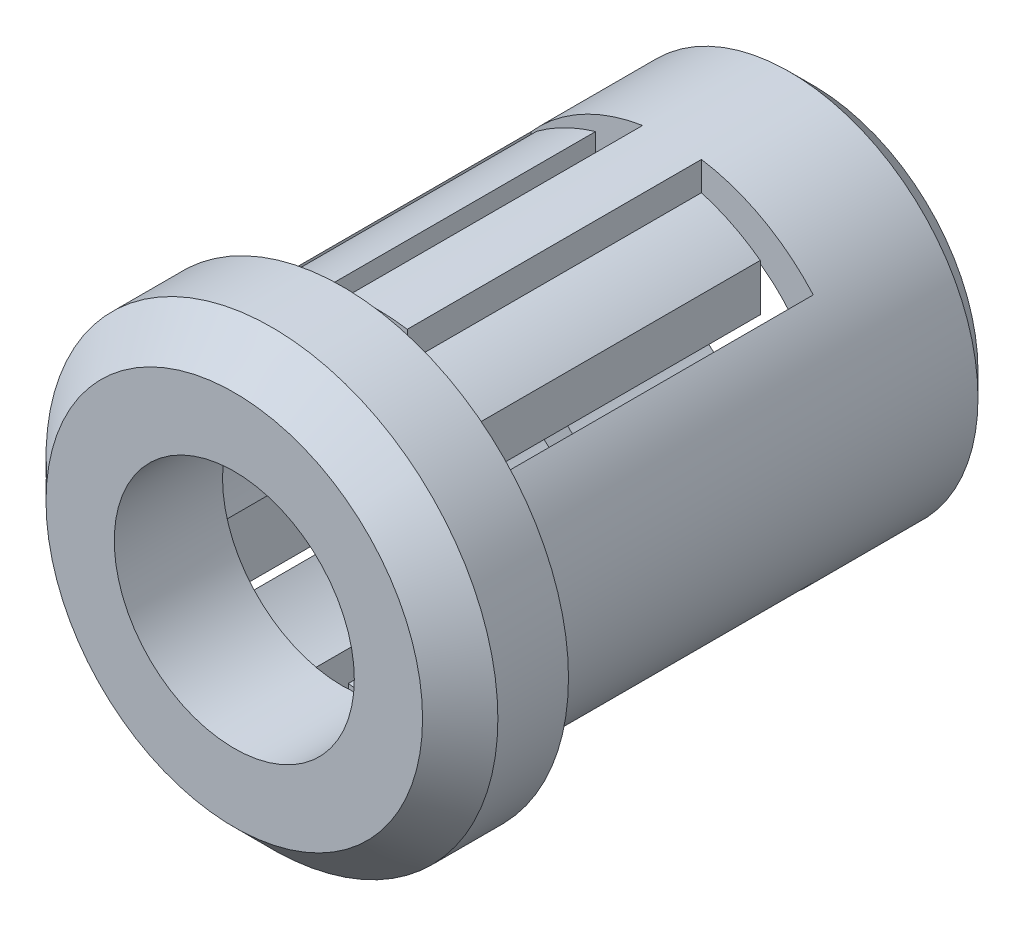
ISO-10303-21;
HEADER;
FILE_DESCRIPTION(('STEP AP214'),'2;1');
FILE_NAME('part.step','',(''),(''),'','','');
FILE_SCHEMA(('AUTOMOTIVE_DESIGN { 1 0 10303 214 1 1 1 1 }'));
ENDSEC;
DATA;
#1=APPLICATION_CONTEXT('core data for automotive mechanical design processes');
#2=APPLICATION_PROTOCOL_DEFINITION('international standard','automotive_design',2000,#1);
#3=PRODUCT_CONTEXT('',#1,'mechanical');
#4=PRODUCT('Part','Part','',(#3));
#5=PRODUCT_RELATED_PRODUCT_CATEGORY('part','',(#4));
#6=PRODUCT_DEFINITION_FORMATION('','',#4);
#7=PRODUCT_DEFINITION_CONTEXT('part definition',#1,'design');
#8=PRODUCT_DEFINITION('design','',#6,#7);
#9=PRODUCT_DEFINITION_SHAPE('','',#8);
#10=(LENGTH_UNIT() NAMED_UNIT(*) SI_UNIT(.MILLI.,.METRE.));
#11=(NAMED_UNIT(*) PLANE_ANGLE_UNIT() SI_UNIT($,.RADIAN.));
#12=(NAMED_UNIT(*) SI_UNIT($,.STERADIAN.) SOLID_ANGLE_UNIT());
#13=UNCERTAINTY_MEASURE_WITH_UNIT(LENGTH_MEASURE(1.E-05),#10,'distance_accuracy_value','');
#14=(GEOMETRIC_REPRESENTATION_CONTEXT(3) GLOBAL_UNCERTAINTY_ASSIGNED_CONTEXT((#13)) GLOBAL_UNIT_ASSIGNED_CONTEXT((#10,
#11,#12)) REPRESENTATION_CONTEXT('',''));
#15=CARTESIAN_POINT('',(0.,0.,0.));
#16=DIRECTION('',(0.,0.,1.));
#17=DIRECTION('',(1.,0.,0.));
#18=AXIS2_PLACEMENT_3D('',#15,#16,#17);
#19=CARTESIAN_POINT('',(0.,0.,10.));
#20=DIRECTION('',(0.,0.,-1.));
#21=DIRECTION('',(-1.,0.,0.));
#22=AXIS2_PLACEMENT_3D('',#19,#20,#21);
#23=CYLINDRICAL_SURFACE('',#22,4.);
#24=CARTESIAN_POINT('',(0.,0.,0.499999999999995));
#25=DIRECTION('',(0.,0.,1.));
#26=DIRECTION('',(1.,0.,0.));
#27=AXIS2_PLACEMENT_3D('',#24,#25,#26);
#28=CIRCLE('',#27,4.);
#29=CARTESIAN_POINT('',(4.,0.,0.499999999999995));
#30=VERTEX_POINT('',#29);
#31=EDGE_CURVE('E281',#30,#30,#28,.T.);
#32=ORIENTED_EDGE('',*,*,#31,.T.);
#33=EDGE_LOOP('',(#32));
#34=FACE_BOUND('',#33,.T.);
#35=CARTESIAN_POINT('',(0.,0.,3.));
#36=DIRECTION('',(0.,0.,-1.));
#37=DIRECTION('',(-1.,0.,0.));
#38=AXIS2_PLACEMENT_3D('',#35,#36,#37);
#39=CIRCLE('',#38,4.);
#40=CARTESIAN_POINT('',(-0.625,-3.95087015731978,3.));
#41=VERTEX_POINT('',#40);
#42=CARTESIAN_POINT('',(-3.,-2.64575131106459,3.));
#43=VERTEX_POINT('',#42);
#44=EDGE_CURVE('E258',#41,#43,#39,.T.);
#45=ORIENTED_EDGE('',*,*,#44,.T.);
#46=DIRECTION('',(0.,0.,-1.));
#47=VECTOR('',#46,1.);
#48=CARTESIAN_POINT('',(-3.,-2.64575131106459,10.));
#49=LINE('',#48,#47);
#50=CARTESIAN_POINT('',(-3.,-2.64575131106459,10.));
#51=VERTEX_POINT('',#50);
#52=EDGE_CURVE('E247',#43,#51,#49,.F.);
#53=ORIENTED_EDGE('',*,*,#52,.T.);
#54=CARTESIAN_POINT('',(0.,0.,10.));
#55=DIRECTION('',(0.,0.,1.));
#56=DIRECTION('',(1.,0.,0.));
#57=AXIS2_PLACEMENT_3D('',#54,#55,#56);
#58=CIRCLE('',#57,4.);
#59=CARTESIAN_POINT('',(-3.,2.64575131106459,10.));
#60=VERTEX_POINT('',#59);
#61=EDGE_CURVE('E256',#60,#51,#58,.T.);
#62=ORIENTED_EDGE('',*,*,#61,.F.);
#63=DIRECTION('',(0.,0.,-1.));
#64=VECTOR('',#63,1.);
#65=CARTESIAN_POINT('',(-3.,2.64575131106459,10.));
#66=LINE('',#65,#64);
#67=CARTESIAN_POINT('',(-3.,2.64575131106459,3.));
#68=VERTEX_POINT('',#67);
#69=EDGE_CURVE('E259',#60,#68,#66,.T.);
#70=ORIENTED_EDGE('',*,*,#69,.T.);
#71=CARTESIAN_POINT('',(-0.625,3.95087015731978,3.));
#72=VERTEX_POINT('',#71);
#73=EDGE_CURVE('E260',#68,#72,#39,.T.);
#74=ORIENTED_EDGE('',*,*,#73,.T.);
#75=DIRECTION('',(0.,0.,-1.));
#76=VECTOR('',#75,1.);
#77=CARTESIAN_POINT('',(-0.624999999999999,3.95087015731978,10.));
#78=LINE('',#77,#76);
#79=CARTESIAN_POINT('',(-0.624999999999999,3.95087015731978,9.25));
#80=VERTEX_POINT('',#79);
#81=EDGE_CURVE('E476',#72,#80,#78,.F.);
#82=ORIENTED_EDGE('',*,*,#81,.T.);
#83=CARTESIAN_POINT('',(0.,0.,9.25));
#84=DIRECTION('',(0.,0.,-1.));
#85=DIRECTION('',(-1.,0.,0.));
#86=AXIS2_PLACEMENT_3D('',#83,#84,#85);
#87=CIRCLE('',#86,4.);
#88=CARTESIAN_POINT('',(0.625000000000001,3.95087015731978,9.25));
#89=VERTEX_POINT('',#88);
#90=EDGE_CURVE('E475',#80,#89,#87,.T.);
#91=ORIENTED_EDGE('',*,*,#90,.T.);
#92=DIRECTION('',(0.,0.,-1.));
#93=VECTOR('',#92,1.);
#94=CARTESIAN_POINT('',(0.625000000000001,3.95087015731978,10.));
#95=LINE('',#94,#93);
#96=CARTESIAN_POINT('',(0.625,3.95087015731978,3.));
#97=VERTEX_POINT('',#96);
#98=EDGE_CURVE('E470',#89,#97,#95,.T.);
#99=ORIENTED_EDGE('',*,*,#98,.T.);
#100=CARTESIAN_POINT('',(0.,0.,3.));
#101=DIRECTION('',(0.,0.,-1.));
#102=DIRECTION('',(-1.,0.,0.));
#103=AXIS2_PLACEMENT_3D('',#100,#101,#102);
#104=CIRCLE('',#103,4.);
#105=CARTESIAN_POINT('',(3.,2.64575131106459,3.));
#106=VERTEX_POINT('',#105);
#107=EDGE_CURVE('E466',#97,#106,#104,.T.);
#108=ORIENTED_EDGE('',*,*,#107,.T.);
#109=DIRECTION('',(0.,0.,-1.));
#110=VECTOR('',#109,1.);
#111=CARTESIAN_POINT('',(3.,2.64575131106459,10.));
#112=LINE('',#111,#110);
#113=CARTESIAN_POINT('',(3.,2.64575131106459,10.));
#114=VERTEX_POINT('',#113);
#115=EDGE_CURVE('E457',#106,#114,#112,.F.);
#116=ORIENTED_EDGE('',*,*,#115,.T.);
#117=CARTESIAN_POINT('',(3.,-2.64575131106459,10.));
#118=VERTEX_POINT('',#117);
#119=EDGE_CURVE('E269',#118,#114,#58,.T.);
#120=ORIENTED_EDGE('',*,*,#119,.F.);
#121=DIRECTION('',(0.,0.,-1.));
#122=VECTOR('',#121,1.);
#123=CARTESIAN_POINT('',(3.,-2.64575131106459,10.));
#124=LINE('',#123,#122);
#125=CARTESIAN_POINT('',(3.,-2.64575131106459,3.));
#126=VERTEX_POINT('',#125);
#127=EDGE_CURVE('E460',#118,#126,#124,.T.);
#128=ORIENTED_EDGE('',*,*,#127,.T.);
#129=CARTESIAN_POINT('',(0.625,-3.95087015731978,3.));
#130=VERTEX_POINT('',#129);
#131=EDGE_CURVE('E463',#126,#130,#104,.T.);
#132=ORIENTED_EDGE('',*,*,#131,.T.);
#133=DIRECTION('',(0.,0.,-1.));
#134=VECTOR('',#133,1.);
#135=CARTESIAN_POINT('',(0.625000000000001,-3.95087015731978,10.));
#136=LINE('',#135,#134);
#137=CARTESIAN_POINT('',(0.625000000000001,-3.95087015731978,9.25));
#138=VERTEX_POINT('',#137);
#139=EDGE_CURVE('E467',#130,#138,#136,.F.);
#140=ORIENTED_EDGE('',*,*,#139,.T.);
#141=CARTESIAN_POINT('',(-0.624999999999999,-3.95087015731978,9.25));
#142=VERTEX_POINT('',#141);
#143=EDGE_CURVE('E473',#138,#142,#87,.T.);
#144=ORIENTED_EDGE('',*,*,#143,.T.);
#145=DIRECTION('',(0.,0.,-1.));
#146=VECTOR('',#145,1.);
#147=CARTESIAN_POINT('',(-0.624999999999999,-3.95087015731978,10.));
#148=LINE('',#147,#146);
#149=EDGE_CURVE('E372',#142,#41,#148,.T.);
#150=ORIENTED_EDGE('',*,*,#149,.T.);
#151=EDGE_LOOP('',(#45,#53,#62,#70,#74,#82,#91,#99,#108,#116,#120,#128,#132,#140,#144,#150));
#152=FACE_BOUND('',#151,.T.);
#153=ADVANCED_FACE('F33',(#34,#152),#23,.T.);
#154=CARTESIAN_POINT('',(0.,0.,3.5));
#155=DIRECTION('',(0.,0.,1.));
#156=DIRECTION('',(1.,0.,0.));
#157=AXIS2_PLACEMENT_3D('',#154,#155,#156);
#158=CIRCLE('',#157,4.);
#159=CARTESIAN_POINT('',(1.125,-3.83853813319602,3.5));
#160=VERTEX_POINT('',#159);
#161=CARTESIAN_POINT('',(2.375,-3.21859829739593,3.5));
#162=VERTEX_POINT('',#161);
#163=EDGE_CURVE('E447',#160,#162,#158,.T.);
#164=ORIENTED_EDGE('',*,*,#163,.T.);
#165=DIRECTION('',(0.,0.,-1.));
#166=VECTOR('',#165,1.);
#167=CARTESIAN_POINT('',(2.375,-3.21859829739593,10.));
#168=LINE('',#167,#166);
#169=CARTESIAN_POINT('',(2.375,-3.21859829739593,10.));
#170=VERTEX_POINT('',#169);
#171=EDGE_CURVE('E451',#162,#170,#168,.F.);
#172=ORIENTED_EDGE('',*,*,#171,.T.);
#173=CARTESIAN_POINT('',(1.125,-3.83853813319602,10.));
#174=VERTEX_POINT('',#173);
#175=EDGE_CURVE('E268',#174,#170,#58,.T.);
#176=ORIENTED_EDGE('',*,*,#175,.F.);
#177=DIRECTION('',(0.,0.,-1.));
#178=VECTOR('',#177,1.);
#179=CARTESIAN_POINT('',(1.125,-3.83853813319602,10.));
#180=LINE('',#179,#178);
#181=EDGE_CURVE('E444',#174,#160,#180,.T.);
#182=ORIENTED_EDGE('',*,*,#181,.T.);
#183=EDGE_LOOP('',(#164,#172,#176,#182));
#184=FACE_BOUND('',#183,.T.);
#185=ADVANCED_FACE('F520',(#184),#23,.T.);
#186=CARTESIAN_POINT('',(2.375,3.21859829739593,10.));
#187=VERTEX_POINT('',#186);
#188=CARTESIAN_POINT('',(1.125,3.83853813319602,10.));
#189=VERTEX_POINT('',#188);
#190=EDGE_CURVE('E267',#187,#189,#58,.T.);
#191=ORIENTED_EDGE('',*,*,#190,.F.);
#192=DIRECTION('',(0.,0.,-1.));
#193=VECTOR('',#192,1.);
#194=CARTESIAN_POINT('',(2.375,3.21859829739593,10.));
#195=LINE('',#194,#193);
#196=CARTESIAN_POINT('',(2.375,3.21859829739593,3.5));
#197=VERTEX_POINT('',#196);
#198=EDGE_CURVE('E454',#187,#197,#195,.T.);
#199=ORIENTED_EDGE('',*,*,#198,.T.);
#200=CARTESIAN_POINT('',(1.125,3.83853813319602,3.5));
#201=VERTEX_POINT('',#200);
#202=EDGE_CURVE('E450',#197,#201,#158,.T.);
#203=ORIENTED_EDGE('',*,*,#202,.T.);
#204=DIRECTION('',(0.,0.,-1.));
#205=VECTOR('',#204,1.);
#206=CARTESIAN_POINT('',(1.125,3.83853813319602,10.));
#207=LINE('',#206,#205);
#208=EDGE_CURVE('E441',#201,#189,#207,.F.);
#209=ORIENTED_EDGE('',*,*,#208,.T.);
#210=EDGE_LOOP('',(#191,#199,#203,#209));
#211=FACE_BOUND('',#210,.T.);
#212=ADVANCED_FACE('F525',(#211),#23,.T.);
#213=CARTESIAN_POINT('',(0.,0.,3.5));
#214=DIRECTION('',(0.,0.,1.));
#215=DIRECTION('',(1.,0.,0.));
#216=AXIS2_PLACEMENT_3D('',#213,#214,#215);
#217=CIRCLE('',#216,4.);
#218=CARTESIAN_POINT('',(-2.375,-3.21859829739593,3.5));
#219=VERTEX_POINT('',#218);
#220=CARTESIAN_POINT('',(-1.125,-3.83853813319602,3.5));
#221=VERTEX_POINT('',#220);
#222=EDGE_CURVE('E431',#219,#221,#217,.T.);
#223=ORIENTED_EDGE('',*,*,#222,.T.);
#224=DIRECTION('',(0.,0.,-1.));
#225=VECTOR('',#224,1.);
#226=CARTESIAN_POINT('',(-1.125,-3.83853813319602,10.));
#227=LINE('',#226,#225);
#228=CARTESIAN_POINT('',(-1.125,-3.83853813319602,10.));
#229=VERTEX_POINT('',#228);
#230=EDGE_CURVE('E435',#221,#229,#227,.F.);
#231=ORIENTED_EDGE('',*,*,#230,.T.);
#232=CARTESIAN_POINT('',(-2.375,-3.21859829739593,10.));
#233=VERTEX_POINT('',#232);
#234=EDGE_CURVE('E264',#233,#229,#58,.T.);
#235=ORIENTED_EDGE('',*,*,#234,.F.);
#236=DIRECTION('',(0.,0.,-1.));
#237=VECTOR('',#236,1.);
#238=CARTESIAN_POINT('',(-2.375,-3.21859829739593,10.));
#239=LINE('',#238,#237);
#240=EDGE_CURVE('E427',#233,#219,#239,.T.);
#241=ORIENTED_EDGE('',*,*,#240,.T.);
#242=EDGE_LOOP('',(#223,#231,#235,#241));
#243=FACE_BOUND('',#242,.T.);
#244=ADVANCED_FACE('F513',(#243),#23,.T.);
#245=CARTESIAN_POINT('',(0.,0.,10.));
#246=DIRECTION('',(0.,0.,-1.));
#247=DIRECTION('',(-1.,0.,0.));
#248=AXIS2_PLACEMENT_3D('',#245,#246,#247);
#249=CYLINDRICAL_SURFACE('',#248,3.25);
#250=CARTESIAN_POINT('',(0.,0.,0.));
#251=DIRECTION('',(0.,0.,-1.));
#252=DIRECTION('',(-1.,0.,0.));
#253=AXIS2_PLACEMENT_3D('',#250,#251,#252);
#254=CIRCLE('',#253,3.25);
#255=CARTESIAN_POINT('',(-3.25,0.,0.));
#256=VERTEX_POINT('',#255);
#257=EDGE_CURVE('E482',#256,#256,#254,.T.);
#258=ORIENTED_EDGE('',*,*,#257,.T.);
#259=EDGE_LOOP('',(#258));
#260=FACE_BOUND('',#259,.T.);
#261=CARTESIAN_POINT('',(0.,0.,10.));
#262=DIRECTION('',(0.,0.,-1.));
#263=DIRECTION('',(-1.,0.,0.));
#264=AXIS2_PLACEMENT_3D('',#261,#262,#263);
#265=CIRCLE('',#264,3.25);
#266=CARTESIAN_POINT('',(-3.,-1.25,10.));
#267=VERTEX_POINT('',#266);
#268=CARTESIAN_POINT('',(-3.,1.25,10.));
#269=VERTEX_POINT('',#268);
#270=EDGE_CURVE('E483',#267,#269,#265,.T.);
#271=ORIENTED_EDGE('',*,*,#270,.F.);
#272=DIRECTION('',(0.,0.,-1.));
#273=VECTOR('',#272,1.);
#274=CARTESIAN_POINT('',(-3.,-1.25,10.));
#275=LINE('',#274,#273);
#276=CARTESIAN_POINT('',(-3.,-1.25,3.));
#277=VERTEX_POINT('',#276);
#278=EDGE_CURVE('E11',#267,#277,#275,.T.);
#279=ORIENTED_EDGE('',*,*,#278,.T.);
#280=CARTESIAN_POINT('',(0.,0.,3.));
#281=DIRECTION('',(0.,0.,-1.));
#282=DIRECTION('',(-1.,0.,0.));
#283=AXIS2_PLACEMENT_3D('',#280,#281,#282);
#284=CIRCLE('',#283,3.25);
#285=CARTESIAN_POINT('',(-0.625,-3.18933770554327,3.));
#286=VERTEX_POINT('',#285);
#287=EDGE_CURVE('E41',#277,#286,#284,.F.);
#288=ORIENTED_EDGE('',*,*,#287,.T.);
#289=DIRECTION('',(0.,0.,-1.));
#290=VECTOR('',#289,1.);
#291=CARTESIAN_POINT('',(-0.624999999999999,-3.18933770554327,10.));
#292=LINE('',#291,#290);
#293=CARTESIAN_POINT('',(-0.624999999999999,-3.18933770554327,9.25));
#294=VERTEX_POINT('',#293);
#295=EDGE_CURVE('E352',#286,#294,#292,.F.);
#296=ORIENTED_EDGE('',*,*,#295,.T.);
#297=CARTESIAN_POINT('',(0.,0.,9.25));
#298=DIRECTION('',(0.,0.,-1.));
#299=DIRECTION('',(-1.,0.,0.));
#300=AXIS2_PLACEMENT_3D('',#297,#298,#299);
#301=CIRCLE('',#300,3.25);
#302=CARTESIAN_POINT('',(0.625000000000001,-3.18933770554327,9.25));
#303=VERTEX_POINT('',#302);
#304=EDGE_CURVE('E338',#294,#303,#301,.F.);
#305=ORIENTED_EDGE('',*,*,#304,.T.);
#306=DIRECTION('',(0.,0.,-1.));
#307=VECTOR('',#306,1.);
#308=CARTESIAN_POINT('',(0.625000000000001,-3.18933770554327,10.));
#309=LINE('',#308,#307);
#310=CARTESIAN_POINT('',(0.625,-3.18933770554327,3.));
#311=VERTEX_POINT('',#310);
#312=EDGE_CURVE('E350',#303,#311,#309,.T.);
#313=ORIENTED_EDGE('',*,*,#312,.T.);
#314=CARTESIAN_POINT('',(0.,0.,3.));
#315=DIRECTION('',(0.,0.,-1.));
#316=DIRECTION('',(-1.,0.,0.));
#317=AXIS2_PLACEMENT_3D('',#314,#315,#316);
#318=CIRCLE('',#317,3.25);
#319=CARTESIAN_POINT('',(3.,-1.25,3.));
#320=VERTEX_POINT('',#319);
#321=EDGE_CURVE('E331',#311,#320,#318,.F.);
#322=ORIENTED_EDGE('',*,*,#321,.T.);
#323=DIRECTION('',(0.,0.,-1.));
#324=VECTOR('',#323,1.);
#325=CARTESIAN_POINT('',(3.,-1.25,10.));
#326=LINE('',#325,#324);
#327=CARTESIAN_POINT('',(3.,-1.25,10.));
#328=VERTEX_POINT('',#327);
#329=EDGE_CURVE('E347',#320,#328,#326,.F.);
#330=ORIENTED_EDGE('',*,*,#329,.T.);
#331=CARTESIAN_POINT('',(3.,1.25,10.));
#332=VERTEX_POINT('',#331);
#333=EDGE_CURVE('E907',#332,#328,#265,.T.);
#334=ORIENTED_EDGE('',*,*,#333,.F.);
#335=DIRECTION('',(0.,0.,-1.));
#336=VECTOR('',#335,1.);
#337=CARTESIAN_POINT('',(3.,1.25,10.));
#338=LINE('',#337,#336);
#339=CARTESIAN_POINT('',(3.,1.25,3.));
#340=VERTEX_POINT('',#339);
#341=EDGE_CURVE('E324',#332,#340,#338,.T.);
#342=ORIENTED_EDGE('',*,*,#341,.T.);
#343=CARTESIAN_POINT('',(0.625,3.18933770554327,3.));
#344=VERTEX_POINT('',#343);
#345=EDGE_CURVE('E327',#340,#344,#318,.F.);
#346=ORIENTED_EDGE('',*,*,#345,.T.);
#347=DIRECTION('',(0.,0.,-1.));
#348=VECTOR('',#347,1.);
#349=CARTESIAN_POINT('',(0.625000000000001,3.18933770554327,10.));
#350=LINE('',#349,#348);
#351=CARTESIAN_POINT('',(0.625000000000001,3.18933770554327,9.25));
#352=VERTEX_POINT('',#351);
#353=EDGE_CURVE('E330',#344,#352,#350,.F.);
#354=ORIENTED_EDGE('',*,*,#353,.T.);
#355=CARTESIAN_POINT('',(-0.624999999999999,3.18933770554327,9.25));
#356=VERTEX_POINT('',#355);
#357=EDGE_CURVE('E334',#352,#356,#301,.F.);
#358=ORIENTED_EDGE('',*,*,#357,.T.);
#359=DIRECTION('',(0.,0.,-1.));
#360=VECTOR('',#359,1.);
#361=CARTESIAN_POINT('',(-0.624999999999999,3.18933770554327,10.));
#362=LINE('',#361,#360);
#363=CARTESIAN_POINT('',(-0.625,3.18933770554327,3.));
#364=VERTEX_POINT('',#363);
#365=EDGE_CURVE('E337',#356,#364,#362,.T.);
#366=ORIENTED_EDGE('',*,*,#365,.T.);
#367=CARTESIAN_POINT('',(-3.,1.25,3.));
#368=VERTEX_POINT('',#367);
#369=EDGE_CURVE('E341',#364,#368,#284,.F.);
#370=ORIENTED_EDGE('',*,*,#369,.T.);
#371=DIRECTION('',(0.,0.,-1.));
#372=VECTOR('',#371,1.);
#373=CARTESIAN_POINT('',(-3.,1.25,10.));
#374=LINE('',#373,#372);
#375=EDGE_CURVE('E344',#368,#269,#374,.F.);
#376=ORIENTED_EDGE('',*,*,#375,.T.);
#377=EDGE_LOOP('',(#271,#279,#288,#296,#305,#313,#322,#330,#334,#342,#346,#354,#358,#366,#370,#376));
#378=FACE_BOUND('',#377,.T.);
#379=ADVANCED_FACE('F357',(#260,#378),#249,.F.);
#380=CARTESIAN_POINT('',(2.375,-2.21852991866236,10.));
#381=VERTEX_POINT('',#380);
#382=CARTESIAN_POINT('',(1.125,-3.04907772941262,10.));
#383=VERTEX_POINT('',#382);
#384=EDGE_CURVE('E911',#381,#383,#265,.T.);
#385=ORIENTED_EDGE('',*,*,#384,.F.);
#386=DIRECTION('',(0.,0.,-1.));
#387=VECTOR('',#386,1.);
#388=CARTESIAN_POINT('',(2.375,-2.21852991866236,10.));
#389=LINE('',#388,#387);
#390=CARTESIAN_POINT('',(2.375,-2.21852991866236,3.5));
#391=VERTEX_POINT('',#390);
#392=EDGE_CURVE('E321',#381,#391,#389,.T.);
#393=ORIENTED_EDGE('',*,*,#392,.T.);
#394=CARTESIAN_POINT('',(0.,0.,3.5));
#395=DIRECTION('',(0.,0.,1.));
#396=DIRECTION('',(1.,0.,0.));
#397=AXIS2_PLACEMENT_3D('',#394,#395,#396);
#398=CIRCLE('',#397,3.25);
#399=CARTESIAN_POINT('',(1.125,-3.04907772941262,3.5));
#400=VERTEX_POINT('',#399);
#401=EDGE_CURVE('E315',#391,#400,#398,.F.);
#402=ORIENTED_EDGE('',*,*,#401,.T.);
#403=DIRECTION('',(0.,0.,-1.));
#404=VECTOR('',#403,1.);
#405=CARTESIAN_POINT('',(1.125,-3.04907772941262,10.));
#406=LINE('',#405,#404);
#407=EDGE_CURVE('E318',#400,#383,#406,.F.);
#408=ORIENTED_EDGE('',*,*,#407,.T.);
#409=EDGE_LOOP('',(#385,#393,#402,#408));
#410=FACE_BOUND('',#409,.T.);
#411=ADVANCED_FACE('F604',(#410),#249,.F.);
#412=CARTESIAN_POINT('',(1.125,3.04907772941262,3.5));
#413=VERTEX_POINT('',#412);
#414=CARTESIAN_POINT('',(2.375,2.21852991866236,3.5));
#415=VERTEX_POINT('',#414);
#416=EDGE_CURVE('E311',#413,#415,#398,.F.);
#417=ORIENTED_EDGE('',*,*,#416,.T.);
#418=DIRECTION('',(0.,0.,-1.));
#419=VECTOR('',#418,1.);
#420=CARTESIAN_POINT('',(2.375,2.21852991866236,10.));
#421=LINE('',#420,#419);
#422=CARTESIAN_POINT('',(2.375,2.21852991866236,10.));
#423=VERTEX_POINT('',#422);
#424=EDGE_CURVE('E314',#415,#423,#421,.F.);
#425=ORIENTED_EDGE('',*,*,#424,.T.);
#426=CARTESIAN_POINT('',(1.125,3.04907772941262,10.));
#427=VERTEX_POINT('',#426);
#428=EDGE_CURVE('E905',#427,#423,#265,.T.);
#429=ORIENTED_EDGE('',*,*,#428,.F.);
#430=DIRECTION('',(0.,0.,-1.));
#431=VECTOR('',#430,1.);
#432=CARTESIAN_POINT('',(1.125,3.04907772941262,10.));
#433=LINE('',#432,#431);
#434=EDGE_CURVE('E308',#427,#413,#433,.T.);
#435=ORIENTED_EDGE('',*,*,#434,.T.);
#436=EDGE_LOOP('',(#417,#425,#429,#435));
#437=FACE_BOUND('',#436,.T.);
#438=ADVANCED_FACE('F514',(#437),#249,.F.);
#439=CARTESIAN_POINT('',(-1.125,-3.04907772941262,10.));
#440=VERTEX_POINT('',#439);
#441=CARTESIAN_POINT('',(-2.375,-2.21852991866236,10.));
#442=VERTEX_POINT('',#441);
#443=EDGE_CURVE('E485',#440,#442,#265,.T.);
#444=ORIENTED_EDGE('',*,*,#443,.F.);
#445=DIRECTION('',(0.,0.,-1.));
#446=VECTOR('',#445,1.);
#447=CARTESIAN_POINT('',(-1.125,-3.04907772941262,10.));
#448=LINE('',#447,#446);
#449=CARTESIAN_POINT('',(-1.125,-3.04907772941262,3.5));
#450=VERTEX_POINT('',#449);
#451=EDGE_CURVE('E305',#440,#450,#448,.T.);
#452=ORIENTED_EDGE('',*,*,#451,.T.);
#453=CARTESIAN_POINT('',(0.,0.,3.5));
#454=DIRECTION('',(0.,0.,1.));
#455=DIRECTION('',(1.,0.,0.));
#456=AXIS2_PLACEMENT_3D('',#453,#454,#455);
#457=CIRCLE('',#456,3.25);
#458=CARTESIAN_POINT('',(-2.375,-2.21852991866236,3.5));
#459=VERTEX_POINT('',#458);
#460=EDGE_CURVE('E299',#450,#459,#457,.F.);
#461=ORIENTED_EDGE('',*,*,#460,.T.);
#462=DIRECTION('',(0.,0.,-1.));
#463=VECTOR('',#462,1.);
#464=CARTESIAN_POINT('',(-2.375,-2.21852991866236,10.));
#465=LINE('',#464,#463);
#466=EDGE_CURVE('E302',#459,#442,#465,.F.);
#467=ORIENTED_EDGE('',*,*,#466,.T.);
#468=EDGE_LOOP('',(#444,#452,#461,#467));
#469=FACE_BOUND('',#468,.T.);
#470=ADVANCED_FACE('F505',(#469),#249,.F.);
#471=CARTESIAN_POINT('',(0.,0.,9.3));
#472=DIRECTION('',(0.,0.,1.));
#473=DIRECTION('',(1.,0.,0.));
#474=AXIS2_PLACEMENT_3D('',#471,#472,#473);
#475=CYLINDRICAL_SURFACE('',#474,2.55);
#476=CARTESIAN_POINT('',(0.,0.,12.3));
#477=DIRECTION('',(0.,0.,1.));
#478=DIRECTION('',(1.,0.,0.));
#479=AXIS2_PLACEMENT_3D('',#476,#477,#478);
#480=CIRCLE('',#479,2.55);
#481=CARTESIAN_POINT('',(2.55,0.,12.3));
#482=VERTEX_POINT('',#481);
#483=EDGE_CURVE('E291',#482,#482,#480,.T.);
#484=ORIENTED_EDGE('',*,*,#483,.T.);
#485=EDGE_LOOP('',(#484));
#486=FACE_BOUND('',#485,.T.);
#487=CARTESIAN_POINT('',(0.,0.,10.));
#488=DIRECTION('',(0.,0.,-1.));
#489=DIRECTION('',(-1.,0.,0.));
#490=AXIS2_PLACEMENT_3D('',#487,#488,#489);
#491=CIRCLE('',#490,2.55);
#492=CARTESIAN_POINT('',(-2.55,0.,10.));
#493=VERTEX_POINT('',#492);
#494=EDGE_CURVE('E288',#493,#493,#491,.F.);
#495=ORIENTED_EDGE('',*,*,#494,.F.);
#496=EDGE_LOOP('',(#495));
#497=FACE_BOUND('',#496,.T.);
#498=ADVANCED_FACE('F502',(#486,#497),#475,.F.);
#499=CARTESIAN_POINT('',(-1.125,3.83853813319602,10.));
#500=VERTEX_POINT('',#499);
#501=CARTESIAN_POINT('',(-2.375,3.21859829739593,10.));
#502=VERTEX_POINT('',#501);
#503=EDGE_CURVE('E263',#500,#502,#58,.T.);
#504=ORIENTED_EDGE('',*,*,#503,.F.);
#505=DIRECTION('',(0.,0.,-1.));
#506=VECTOR('',#505,1.);
#507=CARTESIAN_POINT('',(-1.125,3.83853813319602,10.));
#508=LINE('',#507,#506);
#509=CARTESIAN_POINT('',(-1.125,3.83853813319602,3.5));
#510=VERTEX_POINT('',#509);
#511=EDGE_CURVE('E438',#500,#510,#508,.T.);
#512=ORIENTED_EDGE('',*,*,#511,.T.);
#513=CARTESIAN_POINT('',(-2.375,3.21859829739593,3.5));
#514=VERTEX_POINT('',#513);
#515=EDGE_CURVE('E434',#510,#514,#217,.T.);
#516=ORIENTED_EDGE('',*,*,#515,.T.);
#517=DIRECTION('',(0.,0.,-1.));
#518=VECTOR('',#517,1.);
#519=CARTESIAN_POINT('',(-2.375,3.21859829739593,10.));
#520=LINE('',#519,#518);
#521=EDGE_CURVE('E424',#514,#502,#520,.F.);
#522=ORIENTED_EDGE('',*,*,#521,.T.);
#523=EDGE_LOOP('',(#504,#512,#516,#522));
#524=FACE_BOUND('',#523,.T.);
#525=ADVANCED_FACE('F504',(#524),#23,.T.);
#526=CARTESIAN_POINT('',(0.,0.,0.));
#527=DIRECTION('',(0.,0.,1.));
#528=DIRECTION('',(1.,0.,0.));
#529=AXIS2_PLACEMENT_3D('',#526,#527,#528);
#530=PLANE('',#529);
#531=ORIENTED_EDGE('',*,*,#257,.F.);
#532=EDGE_LOOP('',(#531));
#533=FACE_BOUND('',#532,.T.);
#534=CARTESIAN_POINT('',(0.,0.,0.));
#535=DIRECTION('',(0.,0.,1.));
#536=DIRECTION('',(1.,0.,0.));
#537=AXIS2_PLACEMENT_3D('',#534,#535,#536);
#538=CIRCLE('',#537,3.5);
#539=CARTESIAN_POINT('',(3.5,0.,0.));
#540=VERTEX_POINT('',#539);
#541=EDGE_CURVE('E284',#540,#540,#538,.F.);
#542=ORIENTED_EDGE('',*,*,#541,.T.);
#543=EDGE_LOOP('',(#542));
#544=FACE_BOUND('',#543,.T.);
#545=ADVANCED_FACE('F497',(#533,#544),#530,.F.);
#546=CARTESIAN_POINT('',(0.,0.,10.));
#547=DIRECTION('',(0.,0.,1.));
#548=DIRECTION('',(1.,0.,0.));
#549=AXIS2_PLACEMENT_3D('',#546,#547,#548);
#550=PLANE('',#549);
#551=DIRECTION('',(0.,1.,0.));
#552=VECTOR('',#551,1.);
#553=CARTESIAN_POINT('',(2.375,-5.,10.));
#554=LINE('',#553,#552);
#555=EDGE_CURVE('E397',#423,#187,#554,.T.);
#556=ORIENTED_EDGE('',*,*,#555,.T.);
#557=ORIENTED_EDGE('',*,*,#190,.T.);
#558=DIRECTION('',(0.,1.,0.));
#559=VECTOR('',#558,1.);
#560=CARTESIAN_POINT('',(1.125,-5.,10.));
#561=LINE('',#560,#559);
#562=EDGE_CURVE('E409',#427,#189,#561,.T.);
#563=ORIENTED_EDGE('',*,*,#562,.F.);
#564=ORIENTED_EDGE('',*,*,#428,.T.);
#565=EDGE_LOOP('',(#556,#557,#563,#564));
#566=FACE_BOUND('',#565,.T.);
#567=DIRECTION('',(0.,1.,0.));
#568=VECTOR('',#567,1.);
#569=CARTESIAN_POINT('',(3.,-5.,10.));
#570=LINE('',#569,#568);
#571=EDGE_CURVE('E393',#118,#328,#570,.T.);
#572=ORIENTED_EDGE('',*,*,#571,.F.);
#573=ORIENTED_EDGE('',*,*,#119,.T.);
#574=EDGE_CURVE('E394',#332,#114,#570,.T.);
#575=ORIENTED_EDGE('',*,*,#574,.F.);
#576=ORIENTED_EDGE('',*,*,#333,.T.);
#577=EDGE_LOOP('',(#572,#573,#575,#576));
#578=FACE_BOUND('',#577,.T.);
#579=DIRECTION('',(0.,1.,0.));
#580=VECTOR('',#579,1.);
#581=CARTESIAN_POINT('',(-1.125,-5.,10.));
#582=LINE('',#581,#580);
#583=CARTESIAN_POINT('',(-1.125,3.04907772941262,10.));
#584=VERTEX_POINT('',#583);
#585=EDGE_CURVE('E412',#584,#500,#582,.T.);
#586=ORIENTED_EDGE('',*,*,#585,.T.);
#587=ORIENTED_EDGE('',*,*,#503,.T.);
#588=DIRECTION('',(0.,1.,0.));
#589=VECTOR('',#588,1.);
#590=CARTESIAN_POINT('',(-2.375,-5.,10.));
#591=LINE('',#590,#589);
#592=CARTESIAN_POINT('',(-2.375,2.21852991866236,10.));
#593=VERTEX_POINT('',#592);
#594=EDGE_CURVE('E250',#593,#502,#591,.T.);
#595=ORIENTED_EDGE('',*,*,#594,.F.);
#596=EDGE_CURVE('E292',#593,#584,#265,.T.);
#597=ORIENTED_EDGE('',*,*,#596,.T.);
#598=EDGE_LOOP('',(#586,#587,#595,#597));
#599=FACE_BOUND('',#598,.T.);
#600=EDGE_CURVE('E408',#174,#383,#561,.T.);
#601=ORIENTED_EDGE('',*,*,#600,.F.);
#602=ORIENTED_EDGE('',*,*,#175,.T.);
#603=EDGE_CURVE('E396',#170,#381,#554,.T.);
#604=ORIENTED_EDGE('',*,*,#603,.T.);
#605=ORIENTED_EDGE('',*,*,#384,.T.);
#606=EDGE_LOOP('',(#601,#602,#604,#605));
#607=FACE_BOUND('',#606,.T.);
#608=DIRECTION('',(0.,1.,0.));
#609=VECTOR('',#608,1.);
#610=CARTESIAN_POINT('',(-3.,-5.,10.));
#611=LINE('',#610,#609);
#612=EDGE_CURVE('E56',#269,#60,#611,.T.);
#613=ORIENTED_EDGE('',*,*,#612,.T.);
#614=ORIENTED_EDGE('',*,*,#61,.T.);
#615=EDGE_CURVE('E243',#51,#267,#611,.T.);
#616=ORIENTED_EDGE('',*,*,#615,.T.);
#617=ORIENTED_EDGE('',*,*,#270,.T.);
#618=EDGE_LOOP('',(#613,#614,#616,#617));
#619=FACE_BOUND('',#618,.T.);
#620=ORIENTED_EDGE('',*,*,#234,.T.);
#621=EDGE_CURVE('E411',#229,#440,#582,.T.);
#622=ORIENTED_EDGE('',*,*,#621,.T.);
#623=ORIENTED_EDGE('',*,*,#443,.T.);
#624=EDGE_CURVE('E48',#233,#442,#591,.T.);
#625=ORIENTED_EDGE('',*,*,#624,.F.);
#626=EDGE_LOOP('',(#620,#622,#623,#625));
#627=FACE_BOUND('',#626,.T.);
#628=CARTESIAN_POINT('',(0.,0.,10.));
#629=DIRECTION('',(0.,0.,1.));
#630=DIRECTION('',(1.,0.,0.));
#631=AXIS2_PLACEMENT_3D('',#628,#629,#630);
#632=CIRCLE('',#631,4.8);
#633=CARTESIAN_POINT('',(4.8,0.,10.));
#634=VERTEX_POINT('',#633);
#635=EDGE_CURVE('E273',#634,#634,#632,.T.);
#636=ORIENTED_EDGE('',*,*,#635,.F.);
#637=EDGE_LOOP('',(#636));
#638=FACE_BOUND('',#637,.T.);
#639=ORIENTED_EDGE('',*,*,#494,.T.);
#640=EDGE_LOOP('',(#639));
#641=FACE_BOUND('',#640,.T.);
#642=ADVANCED_FACE('F262',(#566,#578,#599,#607,#619,#627,#638,#641),#550,.F.);
#643=CARTESIAN_POINT('',(0.,0.,12.3));
#644=DIRECTION('',(0.,0.,-1.));
#645=DIRECTION('',(-1.,0.,0.));
#646=AXIS2_PLACEMENT_3D('',#643,#644,#645);
#647=CYLINDRICAL_SURFACE('',#646,4.8);
#648=CARTESIAN_POINT('',(0.,0.,11.5));
#649=DIRECTION('',(0.,0.,1.));
#650=DIRECTION('',(1.,0.,0.));
#651=AXIS2_PLACEMENT_3D('',#648,#649,#650);
#652=CIRCLE('',#651,4.8);
#653=CARTESIAN_POINT('',(4.8,0.,11.5));
#654=VERTEX_POINT('',#653);
#655=EDGE_CURVE('E278',#654,#654,#652,.F.);
#656=ORIENTED_EDGE('',*,*,#655,.T.);
#657=EDGE_LOOP('',(#656));
#658=FACE_BOUND('',#657,.T.);
#659=ORIENTED_EDGE('',*,*,#635,.T.);
#660=EDGE_LOOP('',(#659));
#661=FACE_BOUND('',#660,.T.);
#662=ADVANCED_FACE('F493',(#658,#661),#647,.T.);
#663=CARTESIAN_POINT('',(0.,0.,12.3));
#664=DIRECTION('',(0.,0.,1.));
#665=DIRECTION('',(1.,0.,0.));
#666=AXIS2_PLACEMENT_3D('',#663,#664,#665);
#667=PLANE('',#666);
#668=ORIENTED_EDGE('',*,*,#483,.F.);
#669=EDGE_LOOP('',(#668));
#670=FACE_BOUND('',#669,.T.);
#671=CARTESIAN_POINT('',(0.,0.,12.3));
#672=DIRECTION('',(0.,0.,1.));
#673=DIRECTION('',(1.,0.,0.));
#674=AXIS2_PLACEMENT_3D('',#671,#672,#673);
#675=CIRCLE('',#674,4.00000000000001);
#676=CARTESIAN_POINT('',(4.00000000000001,0.,12.3));
#677=VERTEX_POINT('',#676);
#678=EDGE_CURVE('E275',#677,#677,#675,.T.);
#679=ORIENTED_EDGE('',*,*,#678,.T.);
#680=EDGE_LOOP('',(#679));
#681=FACE_BOUND('',#680,.T.);
#682=ADVANCED_FACE('F531',(#670,#681),#667,.T.);
#683=CARTESIAN_POINT('',(0.,0.,12.3));
#684=DIRECTION('',(0.,0.,-1.));
#685=DIRECTION('',(-1.,0.,0.));
#686=AXIS2_PLACEMENT_3D('',#683,#684,#685);
#687=CONICAL_SURFACE('',#686,4.00000000000001,0.785398163397446);
#688=ORIENTED_EDGE('',*,*,#655,.F.);
#689=EDGE_LOOP('',(#688));
#690=FACE_BOUND('',#689,.T.);
#691=ORIENTED_EDGE('',*,*,#678,.F.);
#692=EDGE_LOOP('',(#691));
#693=FACE_BOUND('',#692,.T.);
#694=ADVANCED_FACE('F529',(#690,#693),#687,.T.);
#695=CARTESIAN_POINT('',(0.,0.,0.499999999999995));
#696=DIRECTION('',(0.,0.,1.));
#697=DIRECTION('',(1.,0.,0.));
#698=AXIS2_PLACEMENT_3D('',#695,#696,#697);
#699=CONICAL_SURFACE('',#698,4.,0.785398163397452);
#700=ORIENTED_EDGE('',*,*,#541,.F.);
#701=EDGE_LOOP('',(#700));
#702=FACE_BOUND('',#701,.T.);
#703=ORIENTED_EDGE('',*,*,#31,.F.);
#704=EDGE_LOOP('',(#703));
#705=FACE_BOUND('',#704,.T.);
#706=ADVANCED_FACE('F35',(#702,#705),#699,.T.);
#707=CARTESIAN_POINT('',(-2.375,2.21852991866236,3.5));
#708=VERTEX_POINT('',#707);
#709=CARTESIAN_POINT('',(-1.125,3.04907772941262,3.5));
#710=VERTEX_POINT('',#709);
#711=EDGE_CURVE('E295',#708,#710,#457,.F.);
#712=ORIENTED_EDGE('',*,*,#711,.T.);
#713=DIRECTION('',(0.,0.,-1.));
#714=VECTOR('',#713,1.);
#715=CARTESIAN_POINT('',(-1.125,3.04907772941262,10.));
#716=LINE('',#715,#714);
#717=EDGE_CURVE('E298',#710,#584,#716,.F.);
#718=ORIENTED_EDGE('',*,*,#717,.T.);
#719=ORIENTED_EDGE('',*,*,#596,.F.);
#720=DIRECTION('',(0.,0.,-1.));
#721=VECTOR('',#720,1.);
#722=CARTESIAN_POINT('',(-2.375,2.21852991866236,10.));
#723=LINE('',#722,#721);
#724=EDGE_CURVE('E287',#593,#708,#723,.T.);
#725=ORIENTED_EDGE('',*,*,#724,.T.);
#726=EDGE_LOOP('',(#712,#718,#719,#725));
#727=FACE_BOUND('',#726,.T.);
#728=ADVANCED_FACE('F517',(#727),#249,.F.);
#729=CARTESIAN_POINT('',(-2.375,-5.,10.));
#730=DIRECTION('',(1.,0.,0.));
#731=DIRECTION('',(0.,0.,-1.));
#732=AXIS2_PLACEMENT_3D('',#729,#730,#731);
#733=PLANE('',#732);
#734=DIRECTION('',(0.,1.,0.));
#735=VECTOR('',#734,1.);
#736=CARTESIAN_POINT('',(-2.375,-5.,3.5));
#737=LINE('',#736,#735);
#738=EDGE_CURVE('E420',#708,#514,#737,.T.);
#739=ORIENTED_EDGE('',*,*,#738,.F.);
#740=ORIENTED_EDGE('',*,*,#724,.F.);
#741=ORIENTED_EDGE('',*,*,#594,.T.);
#742=ORIENTED_EDGE('',*,*,#521,.F.);
#743=EDGE_LOOP('',(#739,#740,#741,#742));
#744=FACE_BOUND('',#743,.T.);
#745=ADVANCED_FACE('F649',(#744),#733,.F.);
#746=CARTESIAN_POINT('',(-2.375,-5.,3.5));
#747=DIRECTION('',(0.,0.,1.));
#748=DIRECTION('',(1.,0.,0.));
#749=AXIS2_PLACEMENT_3D('',#746,#747,#748);
#750=PLANE('',#749);
#751=DIRECTION('',(0.,1.,0.));
#752=VECTOR('',#751,1.);
#753=CARTESIAN_POINT('',(-1.125,-5.,3.5));
#754=LINE('',#753,#752);
#755=EDGE_CURVE('E416',#710,#510,#754,.T.);
#756=ORIENTED_EDGE('',*,*,#755,.F.);
#757=ORIENTED_EDGE('',*,*,#711,.F.);
#758=ORIENTED_EDGE('',*,*,#738,.T.);
#759=ORIENTED_EDGE('',*,*,#515,.F.);
#760=EDGE_LOOP('',(#756,#757,#758,#759));
#761=FACE_BOUND('',#760,.T.);
#762=ADVANCED_FACE('F655',(#761),#750,.F.);
#763=CARTESIAN_POINT('',(-1.125,-5.,10.));
#764=DIRECTION('',(-1.,0.,0.));
#765=DIRECTION('',(0.,0.,1.));
#766=AXIS2_PLACEMENT_3D('',#763,#764,#765);
#767=PLANE('',#766);
#768=ORIENTED_EDGE('',*,*,#585,.F.);
#769=ORIENTED_EDGE('',*,*,#717,.F.);
#770=ORIENTED_EDGE('',*,*,#755,.T.);
#771=ORIENTED_EDGE('',*,*,#511,.F.);
#772=EDGE_LOOP('',(#768,#769,#770,#771));
#773=FACE_BOUND('',#772,.T.);
#774=ADVANCED_FACE('F665',(#773),#767,.F.);
#775=CARTESIAN_POINT('',(1.125,-5.,10.));
#776=DIRECTION('',(1.,0.,0.));
#777=DIRECTION('',(0.,0.,-1.));
#778=AXIS2_PLACEMENT_3D('',#775,#776,#777);
#779=PLANE('',#778);
#780=DIRECTION('',(0.,1.,0.));
#781=VECTOR('',#780,1.);
#782=CARTESIAN_POINT('',(1.125,-5.,3.5));
#783=LINE('',#782,#781);
#784=EDGE_CURVE('E405',#413,#201,#783,.T.);
#785=ORIENTED_EDGE('',*,*,#784,.F.);
#786=ORIENTED_EDGE('',*,*,#434,.F.);
#787=ORIENTED_EDGE('',*,*,#562,.T.);
#788=ORIENTED_EDGE('',*,*,#208,.F.);
#789=EDGE_LOOP('',(#785,#786,#787,#788));
#790=FACE_BOUND('',#789,.T.);
#791=ADVANCED_FACE('F675',(#790),#779,.F.);
#792=CARTESIAN_POINT('',(2.375,-5.,3.5));
#793=DIRECTION('',(0.,0.,1.));
#794=DIRECTION('',(1.,0.,0.));
#795=AXIS2_PLACEMENT_3D('',#792,#793,#794);
#796=PLANE('',#795);
#797=DIRECTION('',(0.,1.,0.));
#798=VECTOR('',#797,1.);
#799=CARTESIAN_POINT('',(2.375,-5.,3.5));
#800=LINE('',#799,#798);
#801=EDGE_CURVE('E401',#415,#197,#800,.T.);
#802=ORIENTED_EDGE('',*,*,#801,.F.);
#803=ORIENTED_EDGE('',*,*,#416,.F.);
#804=ORIENTED_EDGE('',*,*,#784,.T.);
#805=ORIENTED_EDGE('',*,*,#202,.F.);
#806=EDGE_LOOP('',(#802,#803,#804,#805));
#807=FACE_BOUND('',#806,.T.);
#808=ADVANCED_FACE('F685',(#807),#796,.F.);
#809=CARTESIAN_POINT('',(2.375,-5.,10.));
#810=DIRECTION('',(-1.,0.,0.));
#811=DIRECTION('',(0.,0.,1.));
#812=AXIS2_PLACEMENT_3D('',#809,#810,#811);
#813=PLANE('',#812);
#814=ORIENTED_EDGE('',*,*,#555,.F.);
#815=ORIENTED_EDGE('',*,*,#424,.F.);
#816=ORIENTED_EDGE('',*,*,#801,.T.);
#817=ORIENTED_EDGE('',*,*,#198,.F.);
#818=EDGE_LOOP('',(#814,#815,#816,#817));
#819=FACE_BOUND('',#818,.T.);
#820=ADVANCED_FACE('F695',(#819),#813,.F.);
#821=CARTESIAN_POINT('',(3.,-5.,10.));
#822=DIRECTION('',(1.,0.,0.));
#823=DIRECTION('',(0.,0.,-1.));
#824=AXIS2_PLACEMENT_3D('',#821,#822,#823);
#825=PLANE('',#824);
#826=DIRECTION('',(0.,1.,0.));
#827=VECTOR('',#826,1.);
#828=CARTESIAN_POINT('',(3.,-5.,3.));
#829=LINE('',#828,#827);
#830=EDGE_CURVE('E390',#340,#106,#829,.T.);
#831=ORIENTED_EDGE('',*,*,#830,.F.);
#832=ORIENTED_EDGE('',*,*,#341,.F.);
#833=ORIENTED_EDGE('',*,*,#574,.T.);
#834=ORIENTED_EDGE('',*,*,#115,.F.);
#835=EDGE_LOOP('',(#831,#832,#833,#834));
#836=FACE_BOUND('',#835,.T.);
#837=ADVANCED_FACE('F705',(#836),#825,.F.);
#838=CARTESIAN_POINT('',(0.625,-5.,3.));
#839=DIRECTION('',(0.,0.,-1.));
#840=DIRECTION('',(-1.,0.,0.));
#841=AXIS2_PLACEMENT_3D('',#838,#839,#840);
#842=PLANE('',#841);
#843=DIRECTION('',(0.,1.,0.));
#844=VECTOR('',#843,1.);
#845=CARTESIAN_POINT('',(0.625,-5.,3.));
#846=LINE('',#845,#844);
#847=EDGE_CURVE('E386',#344,#97,#846,.T.);
#848=ORIENTED_EDGE('',*,*,#847,.F.);
#849=ORIENTED_EDGE('',*,*,#345,.F.);
#850=ORIENTED_EDGE('',*,*,#830,.T.);
#851=ORIENTED_EDGE('',*,*,#107,.F.);
#852=EDGE_LOOP('',(#848,#849,#850,#851));
#853=FACE_BOUND('',#852,.T.);
#854=ADVANCED_FACE('F715',(#853),#842,.F.);
#855=CARTESIAN_POINT('',(0.625,-5.,3.));
#856=DIRECTION('',(-1.,0.,0.));
#857=DIRECTION('',(0.,0.,1.));
#858=AXIS2_PLACEMENT_3D('',#855,#856,#857);
#859=PLANE('',#858);
#860=DIRECTION('',(0.,1.,0.));
#861=VECTOR('',#860,1.);
#862=CARTESIAN_POINT('',(0.625000000000001,-5.,9.25));
#863=LINE('',#862,#861);
#864=EDGE_CURVE('E382',#352,#89,#863,.T.);
#865=ORIENTED_EDGE('',*,*,#864,.F.);
#866=ORIENTED_EDGE('',*,*,#353,.F.);
#867=ORIENTED_EDGE('',*,*,#847,.T.);
#868=ORIENTED_EDGE('',*,*,#98,.F.);
#869=EDGE_LOOP('',(#865,#866,#867,#868));
#870=FACE_BOUND('',#869,.T.);
#871=ADVANCED_FACE('F725',(#870),#859,.F.);
#872=CARTESIAN_POINT('',(-0.624999999999999,-5.,9.25));
#873=DIRECTION('',(0.,0.,-1.));
#874=DIRECTION('',(-1.,0.,0.));
#875=AXIS2_PLACEMENT_3D('',#872,#873,#874);
#876=PLANE('',#875);
#877=DIRECTION('',(0.,1.,0.));
#878=VECTOR('',#877,1.);
#879=CARTESIAN_POINT('',(-0.624999999999999,-5.,9.25));
#880=LINE('',#879,#878);
#881=EDGE_CURVE('E374',#356,#80,#880,.T.);
#882=ORIENTED_EDGE('',*,*,#881,.F.);
#883=ORIENTED_EDGE('',*,*,#357,.F.);
#884=ORIENTED_EDGE('',*,*,#864,.T.);
#885=ORIENTED_EDGE('',*,*,#90,.F.);
#886=EDGE_LOOP('',(#882,#883,#884,#885));
#887=FACE_BOUND('',#886,.T.);
#888=ADVANCED_FACE('F735',(#887),#876,.F.);
#889=CARTESIAN_POINT('',(-0.625,-5.,3.));
#890=DIRECTION('',(1.,0.,0.));
#891=DIRECTION('',(0.,0.,-1.));
#892=AXIS2_PLACEMENT_3D('',#889,#890,#891);
#893=PLANE('',#892);
#894=DIRECTION('',(0.,1.,0.));
#895=VECTOR('',#894,1.);
#896=CARTESIAN_POINT('',(-0.625,-5.,3.));
#897=LINE('',#896,#895);
#898=EDGE_CURVE('E373',#364,#72,#897,.T.);
#899=ORIENTED_EDGE('',*,*,#898,.F.);
#900=ORIENTED_EDGE('',*,*,#365,.F.);
#901=ORIENTED_EDGE('',*,*,#881,.T.);
#902=ORIENTED_EDGE('',*,*,#81,.F.);
#903=EDGE_LOOP('',(#899,#900,#901,#902));
#904=FACE_BOUND('',#903,.T.);
#905=ADVANCED_FACE('F745',(#904),#893,.F.);
#906=CARTESIAN_POINT('',(-3.,-5.,3.));
#907=DIRECTION('',(0.,0.,-1.));
#908=DIRECTION('',(-1.,0.,0.));
#909=AXIS2_PLACEMENT_3D('',#906,#907,#908);
#910=PLANE('',#909);
#911=DIRECTION('',(0.,1.,0.));
#912=VECTOR('',#911,1.);
#913=CARTESIAN_POINT('',(-3.,-5.,3.));
#914=LINE('',#913,#912);
#915=EDGE_CURVE('E950',#368,#68,#914,.T.);
#916=ORIENTED_EDGE('',*,*,#915,.F.);
#917=ORIENTED_EDGE('',*,*,#369,.F.);
#918=ORIENTED_EDGE('',*,*,#898,.T.);
#919=ORIENTED_EDGE('',*,*,#73,.F.);
#920=EDGE_LOOP('',(#916,#917,#918,#919));
#921=FACE_BOUND('',#920,.T.);
#922=ADVANCED_FACE('F754',(#921),#910,.F.);
#923=CARTESIAN_POINT('',(-3.,-5.,10.));
#924=DIRECTION('',(-1.,0.,0.));
#925=DIRECTION('',(0.,0.,1.));
#926=AXIS2_PLACEMENT_3D('',#923,#924,#925);
#927=PLANE('',#926);
#928=ORIENTED_EDGE('',*,*,#612,.F.);
#929=ORIENTED_EDGE('',*,*,#375,.F.);
#930=ORIENTED_EDGE('',*,*,#915,.T.);
#931=ORIENTED_EDGE('',*,*,#69,.F.);
#932=EDGE_LOOP('',(#928,#929,#930,#931));
#933=FACE_BOUND('',#932,.T.);
#934=ADVANCED_FACE('F763',(#933),#927,.F.);
#935=EDGE_CURVE('E428',#43,#277,#914,.T.);
#936=ORIENTED_EDGE('',*,*,#935,.T.);
#937=ORIENTED_EDGE('',*,*,#278,.F.);
#938=ORIENTED_EDGE('',*,*,#615,.F.);
#939=ORIENTED_EDGE('',*,*,#52,.F.);
#940=EDGE_LOOP('',(#936,#937,#938,#939));
#941=FACE_BOUND('',#940,.T.);
#942=ADVANCED_FACE('F246',(#941),#927,.F.);
#943=EDGE_CURVE('E377',#41,#286,#897,.T.);
#944=ORIENTED_EDGE('',*,*,#943,.T.);
#945=ORIENTED_EDGE('',*,*,#287,.F.);
#946=ORIENTED_EDGE('',*,*,#935,.F.);
#947=ORIENTED_EDGE('',*,*,#44,.F.);
#948=EDGE_LOOP('',(#944,#945,#946,#947));
#949=FACE_BOUND('',#948,.T.);
#950=ADVANCED_FACE('F766',(#949),#910,.F.);
#951=EDGE_CURVE('E364',#142,#294,#880,.T.);
#952=ORIENTED_EDGE('',*,*,#951,.T.);
#953=ORIENTED_EDGE('',*,*,#295,.F.);
#954=ORIENTED_EDGE('',*,*,#943,.F.);
#955=ORIENTED_EDGE('',*,*,#149,.F.);
#956=EDGE_LOOP('',(#952,#953,#954,#955));
#957=FACE_BOUND('',#956,.T.);
#958=ADVANCED_FACE('F369',(#957),#893,.F.);
#959=EDGE_CURVE('E367',#138,#303,#863,.T.);
#960=ORIENTED_EDGE('',*,*,#959,.T.);
#961=ORIENTED_EDGE('',*,*,#304,.F.);
#962=ORIENTED_EDGE('',*,*,#951,.F.);
#963=ORIENTED_EDGE('',*,*,#143,.F.);
#964=EDGE_LOOP('',(#960,#961,#962,#963));
#965=FACE_BOUND('',#964,.T.);
#966=ADVANCED_FACE('F363',(#965),#876,.F.);
#967=EDGE_CURVE('E385',#130,#311,#846,.T.);
#968=ORIENTED_EDGE('',*,*,#967,.T.);
#969=ORIENTED_EDGE('',*,*,#312,.F.);
#970=ORIENTED_EDGE('',*,*,#959,.F.);
#971=ORIENTED_EDGE('',*,*,#139,.F.);
#972=EDGE_LOOP('',(#968,#969,#970,#971));
#973=FACE_BOUND('',#972,.T.);
#974=ADVANCED_FACE('F738',(#973),#859,.F.);
#975=EDGE_CURVE('E389',#126,#320,#829,.T.);
#976=ORIENTED_EDGE('',*,*,#975,.T.);
#977=ORIENTED_EDGE('',*,*,#321,.F.);
#978=ORIENTED_EDGE('',*,*,#967,.F.);
#979=ORIENTED_EDGE('',*,*,#131,.F.);
#980=EDGE_LOOP('',(#976,#977,#978,#979));
#981=FACE_BOUND('',#980,.T.);
#982=ADVANCED_FACE('F728',(#981),#842,.F.);
#983=ORIENTED_EDGE('',*,*,#571,.T.);
#984=ORIENTED_EDGE('',*,*,#329,.F.);
#985=ORIENTED_EDGE('',*,*,#975,.F.);
#986=ORIENTED_EDGE('',*,*,#127,.F.);
#987=EDGE_LOOP('',(#983,#984,#985,#986));
#988=FACE_BOUND('',#987,.T.);
#989=ADVANCED_FACE('F718',(#988),#825,.F.);
#990=EDGE_CURVE('E400',#162,#391,#800,.T.);
#991=ORIENTED_EDGE('',*,*,#990,.T.);
#992=ORIENTED_EDGE('',*,*,#392,.F.);
#993=ORIENTED_EDGE('',*,*,#603,.F.);
#994=ORIENTED_EDGE('',*,*,#171,.F.);
#995=EDGE_LOOP('',(#991,#992,#993,#994));
#996=FACE_BOUND('',#995,.T.);
#997=ADVANCED_FACE('F708',(#996),#813,.F.);
#998=EDGE_CURVE('E404',#160,#400,#783,.T.);
#999=ORIENTED_EDGE('',*,*,#998,.T.);
#1000=ORIENTED_EDGE('',*,*,#401,.F.);
#1001=ORIENTED_EDGE('',*,*,#990,.F.);
#1002=ORIENTED_EDGE('',*,*,#163,.F.);
#1003=EDGE_LOOP('',(#999,#1000,#1001,#1002));
#1004=FACE_BOUND('',#1003,.T.);
#1005=ADVANCED_FACE('F698',(#1004),#796,.F.);
#1006=ORIENTED_EDGE('',*,*,#600,.T.);
#1007=ORIENTED_EDGE('',*,*,#407,.F.);
#1008=ORIENTED_EDGE('',*,*,#998,.F.);
#1009=ORIENTED_EDGE('',*,*,#181,.F.);
#1010=EDGE_LOOP('',(#1006,#1007,#1008,#1009));
#1011=FACE_BOUND('',#1010,.T.);
#1012=ADVANCED_FACE('F688',(#1011),#779,.F.);
#1013=EDGE_CURVE('E415',#221,#450,#754,.T.);
#1014=ORIENTED_EDGE('',*,*,#1013,.T.);
#1015=ORIENTED_EDGE('',*,*,#451,.F.);
#1016=ORIENTED_EDGE('',*,*,#621,.F.);
#1017=ORIENTED_EDGE('',*,*,#230,.F.);
#1018=EDGE_LOOP('',(#1014,#1015,#1016,#1017));
#1019=FACE_BOUND('',#1018,.T.);
#1020=ADVANCED_FACE('F678',(#1019),#767,.F.);
#1021=EDGE_CURVE('E419',#219,#459,#737,.T.);
#1022=ORIENTED_EDGE('',*,*,#1021,.T.);
#1023=ORIENTED_EDGE('',*,*,#460,.F.);
#1024=ORIENTED_EDGE('',*,*,#1013,.F.);
#1025=ORIENTED_EDGE('',*,*,#222,.F.);
#1026=EDGE_LOOP('',(#1022,#1023,#1024,#1025));
#1027=FACE_BOUND('',#1026,.T.);
#1028=ADVANCED_FACE('F668',(#1027),#750,.F.);
#1029=ORIENTED_EDGE('',*,*,#624,.T.);
#1030=ORIENTED_EDGE('',*,*,#466,.F.);
#1031=ORIENTED_EDGE('',*,*,#1021,.F.);
#1032=ORIENTED_EDGE('',*,*,#240,.F.);
#1033=EDGE_LOOP('',(#1029,#1030,#1031,#1032));
#1034=FACE_BOUND('',#1033,.T.);
#1035=ADVANCED_FACE('F658',(#1034),#733,.F.);
#1036=CLOSED_SHELL('',(#153,#185,#212,#244,#379,#411,#438,#470,#498,#525,#545,#642,#662,#682,
#694,#706,#728,#745,#762,#774,#791,#808,#820,#837,#854,#871,#888,#905,#922,#934,#942,#950,#958,
#966,#974,#982,#989,#997,#1005,#1012,#1020,#1028,#1035));
#1037=MANIFOLD_SOLID_BREP('B2',#1036);
#1038=ADVANCED_BREP_SHAPE_REPRESENTATION('',(#18,#1037),#14);
#1039=SHAPE_DEFINITION_REPRESENTATION(#9,#1038);
ENDSEC;
END-ISO-10303-21;
